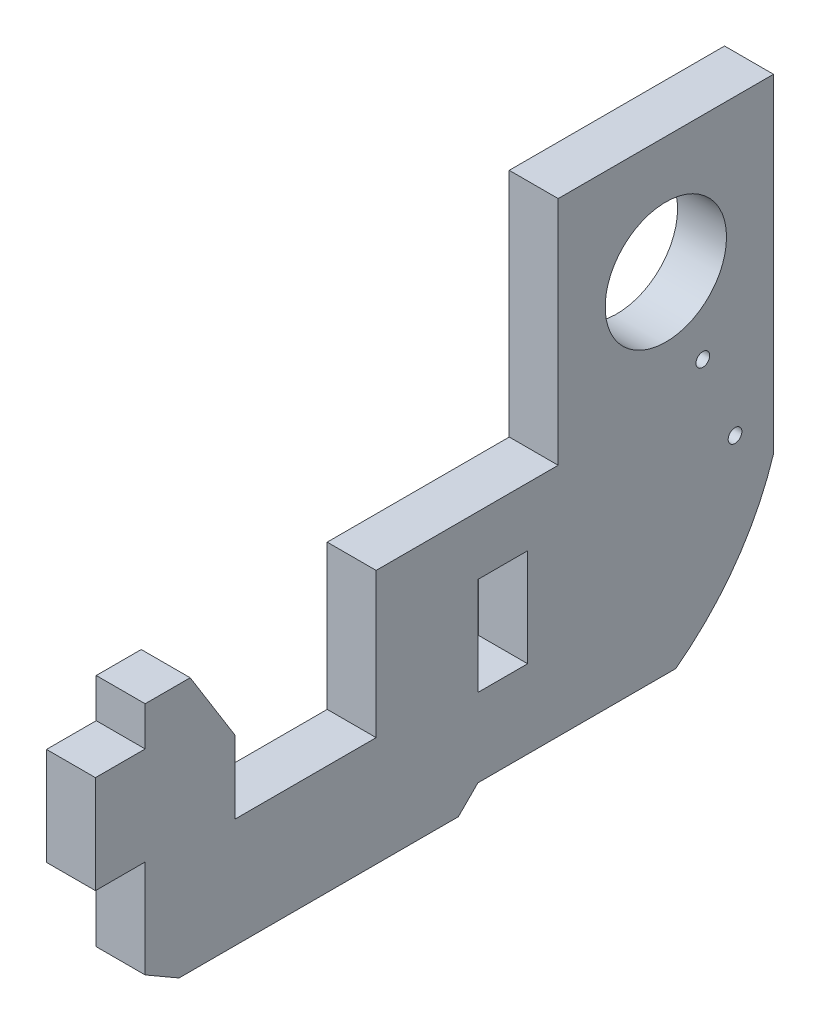
ISO-10303-21;
HEADER;
FILE_DESCRIPTION(('STEP AP214'),'2;1');
FILE_NAME('part.step','',(''),(''),'','','');
FILE_SCHEMA(('AUTOMOTIVE_DESIGN { 1 0 10303 214 1 1 1 1 }'));
ENDSEC;
DATA;
#1=APPLICATION_CONTEXT('core data for automotive mechanical design processes');
#2=APPLICATION_PROTOCOL_DEFINITION('international standard','automotive_design',2000,#1);
#3=PRODUCT_CONTEXT('',#1,'mechanical');
#4=PRODUCT('Part','Part','',(#3));
#5=PRODUCT_RELATED_PRODUCT_CATEGORY('part','',(#4));
#6=PRODUCT_DEFINITION_FORMATION('','',#4);
#7=PRODUCT_DEFINITION_CONTEXT('part definition',#1,'design');
#8=PRODUCT_DEFINITION('design','',#6,#7);
#9=PRODUCT_DEFINITION_SHAPE('','',#8);
#10=(LENGTH_UNIT() NAMED_UNIT(*) SI_UNIT(.MILLI.,.METRE.));
#11=(NAMED_UNIT(*) PLANE_ANGLE_UNIT() SI_UNIT($,.RADIAN.));
#12=(NAMED_UNIT(*) SI_UNIT($,.STERADIAN.) SOLID_ANGLE_UNIT());
#13=UNCERTAINTY_MEASURE_WITH_UNIT(LENGTH_MEASURE(1.E-05),#10,'distance_accuracy_value','');
#14=(GEOMETRIC_REPRESENTATION_CONTEXT(3) GLOBAL_UNCERTAINTY_ASSIGNED_CONTEXT((#13)) GLOBAL_UNIT_ASSIGNED_CONTEXT((#10,
#11,#12)) REPRESENTATION_CONTEXT('',''));
#15=CARTESIAN_POINT('',(0.,0.,0.));
#16=DIRECTION('',(0.,0.,1.));
#17=DIRECTION('',(1.,0.,0.));
#18=AXIS2_PLACEMENT_3D('',#15,#16,#17);
#19=CARTESIAN_POINT('',(3.175,-7.366,6.98500000000005));
#20=DIRECTION('',(-1.,0.,0.));
#21=DIRECTION('',(0.,0.,1.));
#22=AXIS2_PLACEMENT_3D('',#19,#20,#21);
#23=PLANE('',#22);
#24=CARTESIAN_POINT('',(3.175,-6.11130234075188,-2.40063044009705));
#25=DIRECTION('',(1.,0.,0.));
#26=DIRECTION('',(0.,0.,-1.));
#27=AXIS2_PLACEMENT_3D('',#24,#25,#26);
#28=CIRCLE('',#27,0.4445);
#29=CARTESIAN_POINT('',(3.175,-6.11130234075188,-2.84513044009705));
#30=VERTEX_POINT('',#29);
#31=EDGE_CURVE('E319',#30,#30,#28,.T.);
#32=ORIENTED_EDGE('',*,*,#31,.F.);
#33=EDGE_LOOP('',(#32));
#34=FACE_BOUND('',#33,.T.);
#35=CARTESIAN_POINT('',(3.175,0.,0.));
#36=DIRECTION('',(1.,0.,0.));
#37=DIRECTION('',(0.,0.,-1.));
#38=AXIS2_PLACEMENT_3D('',#35,#36,#37);
#39=CIRCLE('',#38,3.937);
#40=CARTESIAN_POINT('',(3.175,0.,-3.937));
#41=VERTEX_POINT('',#40);
#42=EDGE_CURVE('E231',#41,#41,#39,.T.);
#43=ORIENTED_EDGE('',*,*,#42,.F.);
#44=EDGE_LOOP('',(#43));
#45=FACE_BOUND('',#44,.T.);
#46=DIRECTION('',(0.,0.,-1.));
#47=VECTOR('',#46,1.);
#48=CARTESIAN_POINT('',(3.175,-22.606,33.782));
#49=LINE('',#48,#47);
#50=CARTESIAN_POINT('',(3.175,-22.606,12.1919999999999));
#51=VERTEX_POINT('',#50);
#52=CARTESIAN_POINT('',(3.175,-22.606,-0.634999999999901));
#53=VERTEX_POINT('',#52);
#54=EDGE_CURVE('E198',#51,#53,#49,.T.);
#55=ORIENTED_EDGE('',*,*,#54,.T.);
#56=CARTESIAN_POINT('',(3.175,-8.32639222260822,9.9584508883486));
#57=DIRECTION('',(-1.,0.,0.));
#58=DIRECTION('',(0.,0.,1.));
#59=AXIS2_PLACEMENT_3D('',#56,#57,#58);
#60=CIRCLE('',#59,17.78);
#61=CARTESIAN_POINT('',(3.175,-13.716,-6.9849999999999));
#62=VERTEX_POINT('',#61);
#63=EDGE_CURVE('E185',#62,#53,#60,.T.);
#64=ORIENTED_EDGE('',*,*,#63,.F.);
#65=DIRECTION('',(0.,1.,0.));
#66=VECTOR('',#65,1.);
#67=CARTESIAN_POINT('',(3.175,-22.606,-6.9849999999999));
#68=LINE('',#67,#66);
#69=CARTESIAN_POINT('',(3.175,7.62,-6.985));
#70=VERTEX_POINT('',#69);
#71=EDGE_CURVE('E207',#62,#70,#68,.T.);
#72=ORIENTED_EDGE('',*,*,#71,.T.);
#73=DIRECTION('',(0.,0.,1.));
#74=VECTOR('',#73,1.);
#75=CARTESIAN_POINT('',(3.175,7.62,6.985));
#76=LINE('',#75,#74);
#77=CARTESIAN_POINT('',(3.175,7.62,6.985));
#78=VERTEX_POINT('',#77);
#79=EDGE_CURVE('E210',#70,#78,#76,.T.);
#80=ORIENTED_EDGE('',*,*,#79,.T.);
#81=DIRECTION('',(0.,-1.,0.));
#82=VECTOR('',#81,1.);
#83=CARTESIAN_POINT('',(3.175,7.62,6.985));
#84=LINE('',#83,#82);
#85=CARTESIAN_POINT('',(3.175,-7.366,6.98500000000005));
#86=VERTEX_POINT('',#85);
#87=EDGE_CURVE('E258',#78,#86,#84,.T.);
#88=ORIENTED_EDGE('',*,*,#87,.T.);
#89=DIRECTION('',(0.,0.,1.));
#90=VECTOR('',#89,1.);
#91=CARTESIAN_POINT('',(3.175,-7.366,6.98500000000005));
#92=LINE('',#91,#90);
#93=CARTESIAN_POINT('',(3.175,-7.366,18.796));
#94=VERTEX_POINT('',#93);
#95=EDGE_CURVE('E362',#86,#94,#92,.T.);
#96=ORIENTED_EDGE('',*,*,#95,.T.);
#97=DIRECTION('',(0.,-1.,0.));
#98=VECTOR('',#97,1.);
#99=CARTESIAN_POINT('',(3.175,-7.366,18.796));
#100=LINE('',#99,#98);
#101=CARTESIAN_POINT('',(3.175,-16.764,18.796));
#102=VERTEX_POINT('',#101);
#103=EDGE_CURVE('E364',#94,#102,#100,.T.);
#104=ORIENTED_EDGE('',*,*,#103,.T.);
#105=DIRECTION('',(0.,0.,1.));
#106=VECTOR('',#105,1.);
#107=CARTESIAN_POINT('',(3.175,-16.764,18.796));
#108=LINE('',#107,#106);
#109=CARTESIAN_POINT('',(3.175,-16.764,27.94));
#110=VERTEX_POINT('',#109);
#111=EDGE_CURVE('E366',#102,#110,#108,.T.);
#112=ORIENTED_EDGE('',*,*,#111,.T.);
#113=DIRECTION('',(0.,1.,0.));
#114=VECTOR('',#113,1.);
#115=CARTESIAN_POINT('',(3.175,-16.764,27.94));
#116=LINE('',#115,#114);
#117=CARTESIAN_POINT('',(3.175,-12.065,27.94));
#118=VERTEX_POINT('',#117);
#119=EDGE_CURVE('E368',#110,#118,#116,.T.);
#120=ORIENTED_EDGE('',*,*,#119,.T.);
#121=DIRECTION('',(0.,-0.849285325289044,-0.527934121125622));
#122=VECTOR('',#121,1.);
#123=CARTESIAN_POINT('',(3.175,-12.065,27.94));
#124=LINE('',#123,#122);
#125=CARTESIAN_POINT('',(3.175,-7.366,30.861));
#126=VERTEX_POINT('',#125);
#127=EDGE_CURVE('E413',#126,#118,#124,.T.);
#128=ORIENTED_EDGE('',*,*,#127,.F.);
#129=DIRECTION('',(0.,0.,1.));
#130=VECTOR('',#129,1.);
#131=CARTESIAN_POINT('',(3.175,-7.366,27.94));
#132=LINE('',#131,#130);
#133=CARTESIAN_POINT('',(3.175,-7.366,33.782));
#134=VERTEX_POINT('',#133);
#135=EDGE_CURVE('E371',#126,#134,#132,.T.);
#136=ORIENTED_EDGE('',*,*,#135,.T.);
#137=DIRECTION('',(0.,-1.,0.));
#138=VECTOR('',#137,1.);
#139=CARTESIAN_POINT('',(3.175,-7.366,33.782));
#140=LINE('',#139,#138);
#141=CARTESIAN_POINT('',(3.175,-9.90600000000001,33.782));
#142=VERTEX_POINT('',#141);
#143=EDGE_CURVE('E373',#134,#142,#140,.T.);
#144=ORIENTED_EDGE('',*,*,#143,.T.);
#145=DIRECTION('',(0.,0.,1.));
#146=VECTOR('',#145,1.);
#147=CARTESIAN_POINT('',(3.175,-9.90600000000001,33.782));
#148=LINE('',#147,#146);
#149=CARTESIAN_POINT('',(3.175,-9.90600000000001,37.0078));
#150=VERTEX_POINT('',#149);
#151=EDGE_CURVE('E375',#142,#150,#148,.T.);
#152=ORIENTED_EDGE('',*,*,#151,.T.);
#153=DIRECTION('',(0.,-1.,0.));
#154=VECTOR('',#153,1.);
#155=CARTESIAN_POINT('',(3.175,-9.90600000000001,37.0078));
#156=LINE('',#155,#154);
#157=CARTESIAN_POINT('',(3.175,-16.256,37.0078));
#158=VERTEX_POINT('',#157);
#159=EDGE_CURVE('E377',#150,#158,#156,.T.);
#160=ORIENTED_EDGE('',*,*,#159,.T.);
#161=DIRECTION('',(0.,0.,-1.));
#162=VECTOR('',#161,1.);
#163=CARTESIAN_POINT('',(3.175,-16.256,37.0078));
#164=LINE('',#163,#162);
#165=CARTESIAN_POINT('',(3.175,-16.256,33.782));
#166=VERTEX_POINT('',#165);
#167=EDGE_CURVE('E213',#158,#166,#164,.T.);
#168=ORIENTED_EDGE('',*,*,#167,.T.);
#169=DIRECTION('',(0.,-1.,0.));
#170=VECTOR('',#169,1.);
#171=CARTESIAN_POINT('',(3.175,-16.256,33.782));
#172=LINE('',#171,#170);
#173=CARTESIAN_POINT('',(3.175,-22.606,33.782));
#174=VERTEX_POINT('',#173);
#175=EDGE_CURVE('E208',#166,#174,#172,.T.);
#176=ORIENTED_EDGE('',*,*,#175,.T.);
#177=DIRECTION('',(0.,0.5,0.866025403784439));
#178=VECTOR('',#177,1.);
#179=CARTESIAN_POINT('',(3.175,-23.876,31.5822954743875));
#180=LINE('',#179,#178);
#181=CARTESIAN_POINT('',(3.175,-23.876,31.5822954743875));
#182=VERTEX_POINT('',#181);
#183=EDGE_CURVE('E305',#182,#174,#180,.T.);
#184=ORIENTED_EDGE('',*,*,#183,.F.);
#185=DIRECTION('',(0.,0.,1.));
#186=VECTOR('',#185,1.);
#187=CARTESIAN_POINT('',(3.175,-23.876,13.462));
#188=LINE('',#187,#186);
#189=CARTESIAN_POINT('',(3.175,-23.876,13.462));
#190=VERTEX_POINT('',#189);
#191=EDGE_CURVE('E300',#190,#182,#188,.T.);
#192=ORIENTED_EDGE('',*,*,#191,.F.);
#193=DIRECTION('',(0.,-0.707106781186544,0.707106781186551));
#194=VECTOR('',#193,1.);
#195=CARTESIAN_POINT('',(3.175,-23.876,13.462));
#196=LINE('',#195,#194);
#197=EDGE_CURVE('E206',#51,#190,#196,.T.);
#198=ORIENTED_EDGE('',*,*,#197,.F.);
#199=EDGE_LOOP('',(#55,#64,#72,#80,#88,#96,#104,#112,#120,#128,#136,#144,#152,#160,#168,#176,
#184,#192,#198));
#200=FACE_BOUND('',#199,.T.);
#201=DIRECTION('',(0.,1.,0.));
#202=VECTOR('',#201,1.);
#203=CARTESIAN_POINT('',(3.175,-11.176,8.9662));
#204=LINE('',#203,#202);
#205=CARTESIAN_POINT('',(3.175,-17.526,8.9662));
#206=VERTEX_POINT('',#205);
#207=CARTESIAN_POINT('',(3.175,-11.176,8.9662));
#208=VERTEX_POINT('',#207);
#209=EDGE_CURVE('E325',#206,#208,#204,.T.);
#210=ORIENTED_EDGE('',*,*,#209,.F.);
#211=DIRECTION('',(0.,0.,-1.));
#212=VECTOR('',#211,1.);
#213=CARTESIAN_POINT('',(3.175,-17.526,12.192));
#214=LINE('',#213,#212);
#215=CARTESIAN_POINT('',(3.175,-17.526,12.192));
#216=VERTEX_POINT('',#215);
#217=EDGE_CURVE('E333',#216,#206,#214,.T.);
#218=ORIENTED_EDGE('',*,*,#217,.F.);
#219=DIRECTION('',(0.,-1.,0.));
#220=VECTOR('',#219,1.);
#221=CARTESIAN_POINT('',(3.175,-11.176,12.192));
#222=LINE('',#221,#220);
#223=CARTESIAN_POINT('',(3.175,-11.176,12.192));
#224=VERTEX_POINT('',#223);
#225=EDGE_CURVE('E330',#224,#216,#222,.T.);
#226=ORIENTED_EDGE('',*,*,#225,.F.);
#227=DIRECTION('',(0.,0.,1.));
#228=VECTOR('',#227,1.);
#229=CARTESIAN_POINT('',(3.175,-11.176,12.192));
#230=LINE('',#229,#228);
#231=EDGE_CURVE('E327',#208,#224,#230,.T.);
#232=ORIENTED_EDGE('',*,*,#231,.F.);
#233=EDGE_LOOP('',(#210,#218,#226,#232));
#234=FACE_BOUND('',#233,.T.);
#235=CARTESIAN_POINT('',(3.175,-11.4306521271298,-4.49006645368899));
#236=DIRECTION('',(1.,0.,0.));
#237=DIRECTION('',(0.,0.,-1.));
#238=AXIS2_PLACEMENT_3D('',#235,#236,#237);
#239=CIRCLE('',#238,0.4445);
#240=CARTESIAN_POINT('',(3.175,-11.4306521271298,-4.93456645368899));
#241=VERTEX_POINT('',#240);
#242=EDGE_CURVE('E311',#241,#241,#239,.T.);
#243=ORIENTED_EDGE('',*,*,#242,.F.);
#244=EDGE_LOOP('',(#243));
#245=FACE_BOUND('',#244,.T.);
#246=ADVANCED_FACE('F33',(#34,#45,#200,#234,#245),#23,.F.);
#247=CARTESIAN_POINT('',(0.,-7.366,6.98500000000005));
#248=DIRECTION('',(-1.,0.,0.));
#249=DIRECTION('',(0.,0.,1.));
#250=AXIS2_PLACEMENT_3D('',#247,#248,#249);
#251=PLANE('',#250);
#252=CARTESIAN_POINT('',(0.,-8.32639222260822,9.9584508883486));
#253=DIRECTION('',(-1.,0.,0.));
#254=DIRECTION('',(0.,0.,1.));
#255=AXIS2_PLACEMENT_3D('',#252,#253,#254);
#256=CIRCLE('',#255,17.78);
#257=CARTESIAN_POINT('',(0.,-22.606,-0.634999999999901));
#258=VERTEX_POINT('',#257);
#259=CARTESIAN_POINT('',(0.,-13.7159999999999,-6.98499999999993));
#260=VERTEX_POINT('',#259);
#261=EDGE_CURVE('E48',#258,#260,#256,.F.);
#262=ORIENTED_EDGE('',*,*,#261,.F.);
#263=DIRECTION('',(0.,0.,-1.));
#264=VECTOR('',#263,1.);
#265=CARTESIAN_POINT('',(0.,-22.606,33.782));
#266=LINE('',#265,#264);
#267=CARTESIAN_POINT('',(0.,-22.606,12.1919999999999));
#268=VERTEX_POINT('',#267);
#269=EDGE_CURVE('E200',#268,#258,#266,.T.);
#270=ORIENTED_EDGE('',*,*,#269,.F.);
#271=DIRECTION('',(0.,-0.707106781186544,0.707106781186551));
#272=VECTOR('',#271,1.);
#273=CARTESIAN_POINT('',(0.,-23.876,13.462));
#274=LINE('',#273,#272);
#275=CARTESIAN_POINT('',(0.,-23.876,13.462));
#276=VERTEX_POINT('',#275);
#277=EDGE_CURVE('E220',#268,#276,#274,.T.);
#278=ORIENTED_EDGE('',*,*,#277,.T.);
#279=DIRECTION('',(0.,0.,1.));
#280=VECTOR('',#279,1.);
#281=CARTESIAN_POINT('',(0.,-23.876,13.462));
#282=LINE('',#281,#280);
#283=CARTESIAN_POINT('',(0.,-23.876,31.5822954743875));
#284=VERTEX_POINT('',#283);
#285=EDGE_CURVE('E401',#276,#284,#282,.T.);
#286=ORIENTED_EDGE('',*,*,#285,.T.);
#287=DIRECTION('',(0.,0.5,0.866025403784439));
#288=VECTOR('',#287,1.);
#289=CARTESIAN_POINT('',(0.,-23.876,31.5822954743875));
#290=LINE('',#289,#288);
#291=CARTESIAN_POINT('',(0.,-22.606,33.782));
#292=VERTEX_POINT('',#291);
#293=EDGE_CURVE('E301',#284,#292,#290,.T.);
#294=ORIENTED_EDGE('',*,*,#293,.T.);
#295=DIRECTION('',(0.,-1.,0.));
#296=VECTOR('',#295,1.);
#297=CARTESIAN_POINT('',(0.,-16.256,33.782));
#298=LINE('',#297,#296);
#299=CARTESIAN_POINT('',(0.,-16.256,33.782));
#300=VERTEX_POINT('',#299);
#301=EDGE_CURVE('E250',#300,#292,#298,.T.);
#302=ORIENTED_EDGE('',*,*,#301,.F.);
#303=DIRECTION('',(0.,0.,-1.));
#304=VECTOR('',#303,1.);
#305=CARTESIAN_POINT('',(0.,-16.256,37.0078));
#306=LINE('',#305,#304);
#307=CARTESIAN_POINT('',(0.,-16.256,37.0078));
#308=VERTEX_POINT('',#307);
#309=EDGE_CURVE('E248',#308,#300,#306,.T.);
#310=ORIENTED_EDGE('',*,*,#309,.F.);
#311=DIRECTION('',(0.,-1.,0.));
#312=VECTOR('',#311,1.);
#313=CARTESIAN_POINT('',(0.,-9.90600000000001,37.0078));
#314=LINE('',#313,#312);
#315=CARTESIAN_POINT('',(0.,-9.90600000000001,37.0078));
#316=VERTEX_POINT('',#315);
#317=EDGE_CURVE('E246',#316,#308,#314,.T.);
#318=ORIENTED_EDGE('',*,*,#317,.F.);
#319=DIRECTION('',(0.,0.,1.));
#320=VECTOR('',#319,1.);
#321=CARTESIAN_POINT('',(0.,-9.90600000000001,33.782));
#322=LINE('',#321,#320);
#323=CARTESIAN_POINT('',(0.,-9.90600000000001,33.782));
#324=VERTEX_POINT('',#323);
#325=EDGE_CURVE('E244',#324,#316,#322,.T.);
#326=ORIENTED_EDGE('',*,*,#325,.F.);
#327=DIRECTION('',(0.,-1.,0.));
#328=VECTOR('',#327,1.);
#329=CARTESIAN_POINT('',(0.,-7.366,33.782));
#330=LINE('',#329,#328);
#331=CARTESIAN_POINT('',(0.,-7.366,33.782));
#332=VERTEX_POINT('',#331);
#333=EDGE_CURVE('E242',#332,#324,#330,.T.);
#334=ORIENTED_EDGE('',*,*,#333,.F.);
#335=DIRECTION('',(0.,0.,1.));
#336=VECTOR('',#335,1.);
#337=CARTESIAN_POINT('',(0.,-7.366,27.94));
#338=LINE('',#337,#336);
#339=CARTESIAN_POINT('',(0.,-7.366,30.861));
#340=VERTEX_POINT('',#339);
#341=EDGE_CURVE('E240',#340,#332,#338,.T.);
#342=ORIENTED_EDGE('',*,*,#341,.F.);
#343=DIRECTION('',(0.,0.849285325289044,0.527934121125622));
#344=VECTOR('',#343,1.);
#345=CARTESIAN_POINT('',(0.,-18.0712033719705,24.2064141201264));
#346=LINE('',#345,#344);
#347=CARTESIAN_POINT('',(0.,-12.065,27.94));
#348=VERTEX_POINT('',#347);
#349=EDGE_CURVE('E55',#348,#340,#346,.T.);
#350=ORIENTED_EDGE('',*,*,#349,.F.);
#351=DIRECTION('',(0.,1.,0.));
#352=VECTOR('',#351,1.);
#353=CARTESIAN_POINT('',(0.,-16.764,27.94));
#354=LINE('',#353,#352);
#355=CARTESIAN_POINT('',(0.,-16.764,27.94));
#356=VERTEX_POINT('',#355);
#357=EDGE_CURVE('E237',#356,#348,#354,.T.);
#358=ORIENTED_EDGE('',*,*,#357,.F.);
#359=DIRECTION('',(0.,0.,1.));
#360=VECTOR('',#359,1.);
#361=CARTESIAN_POINT('',(0.,-16.764,18.796));
#362=LINE('',#361,#360);
#363=CARTESIAN_POINT('',(0.,-16.764,18.796));
#364=VERTEX_POINT('',#363);
#365=EDGE_CURVE('E235',#364,#356,#362,.T.);
#366=ORIENTED_EDGE('',*,*,#365,.F.);
#367=DIRECTION('',(0.,-1.,0.));
#368=VECTOR('',#367,1.);
#369=CARTESIAN_POINT('',(0.,-7.366,18.796));
#370=LINE('',#369,#368);
#371=CARTESIAN_POINT('',(0.,-7.366,18.796));
#372=VERTEX_POINT('',#371);
#373=EDGE_CURVE('E233',#372,#364,#370,.T.);
#374=ORIENTED_EDGE('',*,*,#373,.F.);
#375=DIRECTION('',(0.,0.,1.));
#376=VECTOR('',#375,1.);
#377=CARTESIAN_POINT('',(0.,-7.366,6.98500000000005));
#378=LINE('',#377,#376);
#379=CARTESIAN_POINT('',(0.,-7.366,6.98500000000005));
#380=VERTEX_POINT('',#379);
#381=EDGE_CURVE('E230',#380,#372,#378,.T.);
#382=ORIENTED_EDGE('',*,*,#381,.F.);
#383=DIRECTION('',(0.,-1.,0.));
#384=VECTOR('',#383,1.);
#385=CARTESIAN_POINT('',(0.,7.62,6.985));
#386=LINE('',#385,#384);
#387=CARTESIAN_POINT('',(0.,7.62,6.985));
#388=VERTEX_POINT('',#387);
#389=EDGE_CURVE('E227',#388,#380,#386,.T.);
#390=ORIENTED_EDGE('',*,*,#389,.F.);
#391=DIRECTION('',(0.,0.,1.));
#392=VECTOR('',#391,1.);
#393=CARTESIAN_POINT('',(0.,7.62,6.985));
#394=LINE('',#393,#392);
#395=CARTESIAN_POINT('',(0.,7.62,-6.985));
#396=VERTEX_POINT('',#395);
#397=EDGE_CURVE('E256',#396,#388,#394,.T.);
#398=ORIENTED_EDGE('',*,*,#397,.F.);
#399=DIRECTION('',(0.,1.,0.));
#400=VECTOR('',#399,1.);
#401=CARTESIAN_POINT('',(0.,-22.606,-6.9849999999999));
#402=LINE('',#401,#400);
#403=EDGE_CURVE('E254',#260,#396,#402,.T.);
#404=ORIENTED_EDGE('',*,*,#403,.F.);
#405=EDGE_LOOP('',(#262,#270,#278,#286,#294,#302,#310,#318,#326,#334,#342,#350,#358,#366,#374,
#382,#390,#398,#404));
#406=FACE_BOUND('',#405,.T.);
#407=CARTESIAN_POINT('',(0.,-6.11130234075188,-2.40063044009705));
#408=DIRECTION('',(1.,0.,0.));
#409=DIRECTION('',(0.,0.,-1.));
#410=AXIS2_PLACEMENT_3D('',#407,#408,#409);
#411=CIRCLE('',#410,0.4445);
#412=CARTESIAN_POINT('',(0.,-6.11130234075188,-2.84513044009705));
#413=VERTEX_POINT('',#412);
#414=EDGE_CURVE('E314',#413,#413,#411,.T.);
#415=ORIENTED_EDGE('',*,*,#414,.T.);
#416=EDGE_LOOP('',(#415));
#417=FACE_BOUND('',#416,.T.);
#418=CARTESIAN_POINT('',(0.,0.,0.));
#419=DIRECTION('',(1.,0.,0.));
#420=DIRECTION('',(0.,0.,-1.));
#421=AXIS2_PLACEMENT_3D('',#418,#419,#420);
#422=CIRCLE('',#421,3.937);
#423=CARTESIAN_POINT('',(0.,0.,-3.937));
#424=VERTEX_POINT('',#423);
#425=EDGE_CURVE('E355',#424,#424,#422,.T.);
#426=ORIENTED_EDGE('',*,*,#425,.T.);
#427=EDGE_LOOP('',(#426));
#428=FACE_BOUND('',#427,.T.);
#429=DIRECTION('',(0.,0.,-1.));
#430=VECTOR('',#429,1.);
#431=CARTESIAN_POINT('',(0.,-17.526,12.192));
#432=LINE('',#431,#430);
#433=CARTESIAN_POINT('',(0.,-17.526,12.192));
#434=VERTEX_POINT('',#433);
#435=CARTESIAN_POINT('',(0.,-17.526,8.9662));
#436=VERTEX_POINT('',#435);
#437=EDGE_CURVE('E328',#434,#436,#432,.T.);
#438=ORIENTED_EDGE('',*,*,#437,.T.);
#439=DIRECTION('',(0.,1.,0.));
#440=VECTOR('',#439,1.);
#441=CARTESIAN_POINT('',(0.,-11.176,8.9662));
#442=LINE('',#441,#440);
#443=CARTESIAN_POINT('',(0.,-11.176,8.9662));
#444=VERTEX_POINT('',#443);
#445=EDGE_CURVE('E322',#436,#444,#442,.T.);
#446=ORIENTED_EDGE('',*,*,#445,.T.);
#447=DIRECTION('',(0.,0.,1.));
#448=VECTOR('',#447,1.);
#449=CARTESIAN_POINT('',(0.,-11.176,12.192));
#450=LINE('',#449,#448);
#451=CARTESIAN_POINT('',(0.,-11.176,12.192));
#452=VERTEX_POINT('',#451);
#453=EDGE_CURVE('E338',#444,#452,#450,.T.);
#454=ORIENTED_EDGE('',*,*,#453,.T.);
#455=DIRECTION('',(0.,-1.,0.));
#456=VECTOR('',#455,1.);
#457=CARTESIAN_POINT('',(0.,-11.176,12.192));
#458=LINE('',#457,#456);
#459=EDGE_CURVE('E341',#452,#434,#458,.T.);
#460=ORIENTED_EDGE('',*,*,#459,.T.);
#461=EDGE_LOOP('',(#438,#446,#454,#460));
#462=FACE_BOUND('',#461,.T.);
#463=CARTESIAN_POINT('',(0.,-11.4306521271298,-4.49006645368899));
#464=DIRECTION('',(1.,0.,0.));
#465=DIRECTION('',(0.,0.,-1.));
#466=AXIS2_PLACEMENT_3D('',#463,#464,#465);
#467=CIRCLE('',#466,0.4445);
#468=CARTESIAN_POINT('',(0.,-11.4306521271298,-4.93456645368899));
#469=VERTEX_POINT('',#468);
#470=EDGE_CURVE('E315',#469,#469,#467,.T.);
#471=ORIENTED_EDGE('',*,*,#470,.T.);
#472=EDGE_LOOP('',(#471));
#473=FACE_BOUND('',#472,.T.);
#474=ADVANCED_FACE('F397',(#406,#417,#428,#462,#473),#251,.T.);
#475=CARTESIAN_POINT('',(3.175,7.62,6.985));
#476=DIRECTION('',(0.,0.,-1.));
#477=DIRECTION('',(0.,1.,0.));
#478=AXIS2_PLACEMENT_3D('',#475,#476,#477);
#479=PLANE('',#478);
#480=ORIENTED_EDGE('',*,*,#389,.T.);
#481=DIRECTION('',(-1.,0.,0.));
#482=VECTOR('',#481,1.);
#483=CARTESIAN_POINT('',(3.175,-7.366,6.98500000000005));
#484=LINE('',#483,#482);
#485=EDGE_CURVE('E289',#86,#380,#484,.T.);
#486=ORIENTED_EDGE('',*,*,#485,.F.);
#487=ORIENTED_EDGE('',*,*,#87,.F.);
#488=DIRECTION('',(-1.,0.,0.));
#489=VECTOR('',#488,1.);
#490=CARTESIAN_POINT('',(3.175,7.62,6.985));
#491=LINE('',#490,#489);
#492=EDGE_CURVE('E226',#78,#388,#491,.T.);
#493=ORIENTED_EDGE('',*,*,#492,.T.);
#494=EDGE_LOOP('',(#480,#486,#487,#493));
#495=FACE_BOUND('',#494,.T.);
#496=ADVANCED_FACE('F35',(#495),#479,.F.);
#497=CARTESIAN_POINT('',(3.175,-7.366,6.98500000000005));
#498=DIRECTION('',(0.,-1.,0.));
#499=DIRECTION('',(0.,0.,-1.));
#500=AXIS2_PLACEMENT_3D('',#497,#498,#499);
#501=PLANE('',#500);
#502=ORIENTED_EDGE('',*,*,#381,.T.);
#503=DIRECTION('',(-1.,0.,0.));
#504=VECTOR('',#503,1.);
#505=CARTESIAN_POINT('',(3.175,-7.366,18.796));
#506=LINE('',#505,#504);
#507=EDGE_CURVE('E287',#94,#372,#506,.T.);
#508=ORIENTED_EDGE('',*,*,#507,.F.);
#509=ORIENTED_EDGE('',*,*,#95,.F.);
#510=ORIENTED_EDGE('',*,*,#485,.T.);
#511=EDGE_LOOP('',(#502,#508,#509,#510));
#512=FACE_BOUND('',#511,.T.);
#513=ADVANCED_FACE('F676',(#512),#501,.F.);
#514=CARTESIAN_POINT('',(3.175,-7.366,18.796));
#515=DIRECTION('',(0.,0.,-1.));
#516=DIRECTION('',(-1.,0.,0.));
#517=AXIS2_PLACEMENT_3D('',#514,#515,#516);
#518=PLANE('',#517);
#519=ORIENTED_EDGE('',*,*,#373,.T.);
#520=DIRECTION('',(-1.,0.,0.));
#521=VECTOR('',#520,1.);
#522=CARTESIAN_POINT('',(3.175,-16.764,18.796));
#523=LINE('',#522,#521);
#524=EDGE_CURVE('E284',#102,#364,#523,.T.);
#525=ORIENTED_EDGE('',*,*,#524,.F.);
#526=ORIENTED_EDGE('',*,*,#103,.F.);
#527=ORIENTED_EDGE('',*,*,#507,.T.);
#528=EDGE_LOOP('',(#519,#525,#526,#527));
#529=FACE_BOUND('',#528,.T.);
#530=ADVANCED_FACE('F668',(#529),#518,.F.);
#531=CARTESIAN_POINT('',(3.175,-16.764,18.796));
#532=DIRECTION('',(0.,-1.,0.));
#533=DIRECTION('',(0.,0.,-1.));
#534=AXIS2_PLACEMENT_3D('',#531,#532,#533);
#535=PLANE('',#534);
#536=ORIENTED_EDGE('',*,*,#365,.T.);
#537=DIRECTION('',(-1.,0.,0.));
#538=VECTOR('',#537,1.);
#539=CARTESIAN_POINT('',(3.175,-16.764,27.94));
#540=LINE('',#539,#538);
#541=EDGE_CURVE('E281',#110,#356,#540,.T.);
#542=ORIENTED_EDGE('',*,*,#541,.F.);
#543=ORIENTED_EDGE('',*,*,#111,.F.);
#544=ORIENTED_EDGE('',*,*,#524,.T.);
#545=EDGE_LOOP('',(#536,#542,#543,#544));
#546=FACE_BOUND('',#545,.T.);
#547=ADVANCED_FACE('F429',(#546),#535,.F.);
#548=CARTESIAN_POINT('',(3.175,-16.764,27.94));
#549=DIRECTION('',(0.,0.,1.));
#550=DIRECTION('',(1.,0.,0.));
#551=AXIS2_PLACEMENT_3D('',#548,#549,#550);
#552=PLANE('',#551);
#553=ORIENTED_EDGE('',*,*,#357,.T.);
#554=DIRECTION('',(1.,0.,0.));
#555=VECTOR('',#554,1.);
#556=CARTESIAN_POINT('',(-5.00000000001367E-05,-12.065,27.94));
#557=LINE('',#556,#555);
#558=EDGE_CURVE('E410',#348,#118,#557,.T.);
#559=ORIENTED_EDGE('',*,*,#558,.T.);
#560=ORIENTED_EDGE('',*,*,#119,.F.);
#561=ORIENTED_EDGE('',*,*,#541,.T.);
#562=EDGE_LOOP('',(#553,#559,#560,#561));
#563=FACE_BOUND('',#562,.T.);
#564=ADVANCED_FACE('F422',(#563),#552,.F.);
#565=CARTESIAN_POINT('',(3.175,-7.366,27.94));
#566=DIRECTION('',(0.,-1.,0.));
#567=DIRECTION('',(0.,0.,-1.));
#568=AXIS2_PLACEMENT_3D('',#565,#566,#567);
#569=PLANE('',#568);
#570=ORIENTED_EDGE('',*,*,#135,.F.);
#571=DIRECTION('',(-1.,0.,0.));
#572=VECTOR('',#571,1.);
#573=CARTESIAN_POINT('',(3.175,-7.366,30.861));
#574=LINE('',#573,#572);
#575=EDGE_CURVE('E41',#126,#340,#574,.T.);
#576=ORIENTED_EDGE('',*,*,#575,.T.);
#577=ORIENTED_EDGE('',*,*,#341,.T.);
#578=DIRECTION('',(-1.,0.,0.));
#579=VECTOR('',#578,1.);
#580=CARTESIAN_POINT('',(3.175,-7.366,33.782));
#581=LINE('',#580,#579);
#582=EDGE_CURVE('E278',#134,#332,#581,.T.);
#583=ORIENTED_EDGE('',*,*,#582,.F.);
#584=EDGE_LOOP('',(#570,#576,#577,#583));
#585=FACE_BOUND('',#584,.T.);
#586=ADVANCED_FACE('F435',(#585),#569,.F.);
#587=CARTESIAN_POINT('',(3.175,-7.366,33.782));
#588=DIRECTION('',(0.,0.,-1.));
#589=DIRECTION('',(0.,1.,0.));
#590=AXIS2_PLACEMENT_3D('',#587,#588,#589);
#591=PLANE('',#590);
#592=ORIENTED_EDGE('',*,*,#333,.T.);
#593=DIRECTION('',(-1.,0.,0.));
#594=VECTOR('',#593,1.);
#595=CARTESIAN_POINT('',(3.175,-9.90600000000001,33.782));
#596=LINE('',#595,#594);
#597=EDGE_CURVE('E275',#142,#324,#596,.T.);
#598=ORIENTED_EDGE('',*,*,#597,.F.);
#599=ORIENTED_EDGE('',*,*,#143,.F.);
#600=ORIENTED_EDGE('',*,*,#582,.T.);
#601=EDGE_LOOP('',(#592,#598,#599,#600));
#602=FACE_BOUND('',#601,.T.);
#603=ADVANCED_FACE('F438',(#602),#591,.F.);
#604=CARTESIAN_POINT('',(3.175,-9.90600000000001,33.782));
#605=DIRECTION('',(0.,-1.,0.));
#606=DIRECTION('',(0.,0.,-1.));
#607=AXIS2_PLACEMENT_3D('',#604,#605,#606);
#608=PLANE('',#607);
#609=ORIENTED_EDGE('',*,*,#325,.T.);
#610=DIRECTION('',(-1.,0.,0.));
#611=VECTOR('',#610,1.);
#612=CARTESIAN_POINT('',(3.175,-9.90600000000001,37.0078));
#613=LINE('',#612,#611);
#614=EDGE_CURVE('E272',#150,#316,#613,.T.);
#615=ORIENTED_EDGE('',*,*,#614,.F.);
#616=ORIENTED_EDGE('',*,*,#151,.F.);
#617=ORIENTED_EDGE('',*,*,#597,.T.);
#618=EDGE_LOOP('',(#609,#615,#616,#617));
#619=FACE_BOUND('',#618,.T.);
#620=ADVANCED_FACE('F443',(#619),#608,.F.);
#621=CARTESIAN_POINT('',(3.175,-9.90600000000001,37.0078));
#622=DIRECTION('',(0.,0.,-1.));
#623=DIRECTION('',(-1.,0.,0.));
#624=AXIS2_PLACEMENT_3D('',#621,#622,#623);
#625=PLANE('',#624);
#626=ORIENTED_EDGE('',*,*,#317,.T.);
#627=DIRECTION('',(-1.,0.,0.));
#628=VECTOR('',#627,1.);
#629=CARTESIAN_POINT('',(3.175,-16.256,37.0078));
#630=LINE('',#629,#628);
#631=EDGE_CURVE('E269',#158,#308,#630,.T.);
#632=ORIENTED_EDGE('',*,*,#631,.F.);
#633=ORIENTED_EDGE('',*,*,#159,.F.);
#634=ORIENTED_EDGE('',*,*,#614,.T.);
#635=EDGE_LOOP('',(#626,#632,#633,#634));
#636=FACE_BOUND('',#635,.T.);
#637=ADVANCED_FACE('F446',(#636),#625,.F.);
#638=CARTESIAN_POINT('',(3.175,-16.256,37.0078));
#639=DIRECTION('',(0.,1.,0.));
#640=DIRECTION('',(0.,0.,1.));
#641=AXIS2_PLACEMENT_3D('',#638,#639,#640);
#642=PLANE('',#641);
#643=ORIENTED_EDGE('',*,*,#309,.T.);
#644=DIRECTION('',(-1.,0.,0.));
#645=VECTOR('',#644,1.);
#646=CARTESIAN_POINT('',(3.175,-16.256,33.782));
#647=LINE('',#646,#645);
#648=EDGE_CURVE('E266',#166,#300,#647,.T.);
#649=ORIENTED_EDGE('',*,*,#648,.F.);
#650=ORIENTED_EDGE('',*,*,#167,.F.);
#651=ORIENTED_EDGE('',*,*,#631,.T.);
#652=EDGE_LOOP('',(#643,#649,#650,#651));
#653=FACE_BOUND('',#652,.T.);
#654=ADVANCED_FACE('F386',(#653),#642,.F.);
#655=CARTESIAN_POINT('',(3.175,-16.256,33.782));
#656=DIRECTION('',(0.,0.,-1.));
#657=DIRECTION('',(0.,1.,0.));
#658=AXIS2_PLACEMENT_3D('',#655,#656,#657);
#659=PLANE('',#658);
#660=ORIENTED_EDGE('',*,*,#301,.T.);
#661=DIRECTION('',(-1.,0.,0.));
#662=VECTOR('',#661,1.);
#663=CARTESIAN_POINT('',(3.175,-22.606,33.782));
#664=LINE('',#663,#662);
#665=EDGE_CURVE('E264',#174,#292,#664,.T.);
#666=ORIENTED_EDGE('',*,*,#665,.F.);
#667=ORIENTED_EDGE('',*,*,#175,.F.);
#668=ORIENTED_EDGE('',*,*,#648,.T.);
#669=EDGE_LOOP('',(#660,#666,#667,#668));
#670=FACE_BOUND('',#669,.T.);
#671=ADVANCED_FACE('F390',(#670),#659,.F.);
#672=CARTESIAN_POINT('',(3.175,-22.606,33.782));
#673=DIRECTION('',(0.,1.,0.));
#674=DIRECTION('',(0.,0.,1.));
#675=AXIS2_PLACEMENT_3D('',#672,#673,#674);
#676=PLANE('',#675);
#677=ORIENTED_EDGE('',*,*,#269,.T.);
#678=DIRECTION('',(1.,0.,0.));
#679=VECTOR('',#678,1.);
#680=CARTESIAN_POINT('',(-5.00000000001367E-05,-22.606,-0.634999999999901));
#681=LINE('',#680,#679);
#682=EDGE_CURVE('E188',#258,#53,#681,.T.);
#683=ORIENTED_EDGE('',*,*,#682,.T.);
#684=ORIENTED_EDGE('',*,*,#54,.F.);
#685=DIRECTION('',(-1.,0.,0.));
#686=VECTOR('',#685,1.);
#687=CARTESIAN_POINT('',(3.175,-22.606,12.1919999999999));
#688=LINE('',#687,#686);
#689=EDGE_CURVE('E302',#51,#268,#688,.T.);
#690=ORIENTED_EDGE('',*,*,#689,.T.);
#691=EDGE_LOOP('',(#677,#683,#684,#690));
#692=FACE_BOUND('',#691,.T.);
#693=ADVANCED_FACE('F196',(#692),#676,.F.);
#694=CARTESIAN_POINT('',(3.175,-22.606,-6.9849999999999));
#695=DIRECTION('',(0.,0.,1.));
#696=DIRECTION('',(0.,-1.,0.));
#697=AXIS2_PLACEMENT_3D('',#694,#695,#696);
#698=PLANE('',#697);
#699=ORIENTED_EDGE('',*,*,#71,.F.);
#700=DIRECTION('',(1.,0.,0.));
#701=VECTOR('',#700,1.);
#702=CARTESIAN_POINT('',(-5.00000000001367E-05,-13.7159999999999,-6.98499999999993));
#703=LINE('',#702,#701);
#704=EDGE_CURVE('E11',#62,#260,#703,.F.);
#705=ORIENTED_EDGE('',*,*,#704,.T.);
#706=ORIENTED_EDGE('',*,*,#403,.T.);
#707=DIRECTION('',(-1.,0.,0.));
#708=VECTOR('',#707,1.);
#709=CARTESIAN_POINT('',(3.175,7.62,-6.985));
#710=LINE('',#709,#708);
#711=EDGE_CURVE('E261',#70,#396,#710,.T.);
#712=ORIENTED_EDGE('',*,*,#711,.F.);
#713=EDGE_LOOP('',(#699,#705,#706,#712));
#714=FACE_BOUND('',#713,.T.);
#715=ADVANCED_FACE('F471',(#714),#698,.F.);
#716=CARTESIAN_POINT('',(3.175,7.62,6.985));
#717=DIRECTION('',(0.,-1.,0.));
#718=DIRECTION('',(0.,0.,-1.));
#719=AXIS2_PLACEMENT_3D('',#716,#717,#718);
#720=PLANE('',#719);
#721=ORIENTED_EDGE('',*,*,#397,.T.);
#722=ORIENTED_EDGE('',*,*,#492,.F.);
#723=ORIENTED_EDGE('',*,*,#79,.F.);
#724=ORIENTED_EDGE('',*,*,#711,.T.);
#725=EDGE_LOOP('',(#721,#722,#723,#724));
#726=FACE_BOUND('',#725,.T.);
#727=ADVANCED_FACE('F468',(#726),#720,.F.);
#728=CARTESIAN_POINT('',(3.175,0.,0.));
#729=DIRECTION('',(-1.,0.,0.));
#730=DIRECTION('',(0.,0.,1.));
#731=AXIS2_PLACEMENT_3D('',#728,#729,#730);
#732=CYLINDRICAL_SURFACE('',#731,3.937);
#733=ORIENTED_EDGE('',*,*,#42,.T.);
#734=EDGE_LOOP('',(#733));
#735=FACE_BOUND('',#734,.T.);
#736=ORIENTED_EDGE('',*,*,#425,.F.);
#737=EDGE_LOOP('',(#736));
#738=FACE_BOUND('',#737,.T.);
#739=ADVANCED_FACE('F465',(#735,#738),#732,.F.);
#740=CARTESIAN_POINT('',(3.175,-11.176,8.9662));
#741=DIRECTION('',(0.,0.,1.));
#742=DIRECTION('',(1.,0.,0.));
#743=AXIS2_PLACEMENT_3D('',#740,#741,#742);
#744=PLANE('',#743);
#745=ORIENTED_EDGE('',*,*,#445,.F.);
#746=DIRECTION('',(-1.,0.,0.));
#747=VECTOR('',#746,1.);
#748=CARTESIAN_POINT('',(3.175,-17.526,8.9662));
#749=LINE('',#748,#747);
#750=EDGE_CURVE('E335',#206,#436,#749,.T.);
#751=ORIENTED_EDGE('',*,*,#750,.F.);
#752=ORIENTED_EDGE('',*,*,#209,.T.);
#753=DIRECTION('',(-1.,0.,0.));
#754=VECTOR('',#753,1.);
#755=CARTESIAN_POINT('',(3.175,-11.176,8.9662));
#756=LINE('',#755,#754);
#757=EDGE_CURVE('E352',#208,#444,#756,.T.);
#758=ORIENTED_EDGE('',*,*,#757,.T.);
#759=EDGE_LOOP('',(#745,#751,#752,#758));
#760=FACE_BOUND('',#759,.T.);
#761=ADVANCED_FACE('F505',(#760),#744,.T.);
#762=CARTESIAN_POINT('',(3.175,-11.176,12.192));
#763=DIRECTION('',(0.,-1.,0.));
#764=DIRECTION('',(0.,0.,-1.));
#765=AXIS2_PLACEMENT_3D('',#762,#763,#764);
#766=PLANE('',#765);
#767=ORIENTED_EDGE('',*,*,#453,.F.);
#768=ORIENTED_EDGE('',*,*,#757,.F.);
#769=ORIENTED_EDGE('',*,*,#231,.T.);
#770=DIRECTION('',(-1.,0.,0.));
#771=VECTOR('',#770,1.);
#772=CARTESIAN_POINT('',(3.175,-11.176,12.192));
#773=LINE('',#772,#771);
#774=EDGE_CURVE('E350',#224,#452,#773,.T.);
#775=ORIENTED_EDGE('',*,*,#774,.T.);
#776=EDGE_LOOP('',(#767,#768,#769,#775));
#777=FACE_BOUND('',#776,.T.);
#778=ADVANCED_FACE('F512',(#777),#766,.T.);
#779=CARTESIAN_POINT('',(3.175,-11.176,12.192));
#780=DIRECTION('',(0.,0.,-1.));
#781=DIRECTION('',(-1.,0.,0.));
#782=AXIS2_PLACEMENT_3D('',#779,#780,#781);
#783=PLANE('',#782);
#784=ORIENTED_EDGE('',*,*,#459,.F.);
#785=ORIENTED_EDGE('',*,*,#774,.F.);
#786=ORIENTED_EDGE('',*,*,#225,.T.);
#787=DIRECTION('',(-1.,0.,0.));
#788=VECTOR('',#787,1.);
#789=CARTESIAN_POINT('',(3.175,-17.526,12.192));
#790=LINE('',#789,#788);
#791=EDGE_CURVE('E348',#216,#434,#790,.T.);
#792=ORIENTED_EDGE('',*,*,#791,.T.);
#793=EDGE_LOOP('',(#784,#785,#786,#792));
#794=FACE_BOUND('',#793,.T.);
#795=ADVANCED_FACE('F519',(#794),#783,.T.);
#796=CARTESIAN_POINT('',(3.175,-17.526,12.192));
#797=DIRECTION('',(0.,1.,0.));
#798=DIRECTION('',(0.,0.,1.));
#799=AXIS2_PLACEMENT_3D('',#796,#797,#798);
#800=PLANE('',#799);
#801=ORIENTED_EDGE('',*,*,#437,.F.);
#802=ORIENTED_EDGE('',*,*,#791,.F.);
#803=ORIENTED_EDGE('',*,*,#217,.T.);
#804=ORIENTED_EDGE('',*,*,#750,.T.);
#805=EDGE_LOOP('',(#801,#802,#803,#804));
#806=FACE_BOUND('',#805,.T.);
#807=ADVANCED_FACE('F527',(#806),#800,.T.);
#808=CARTESIAN_POINT('',(3.175,-6.11130234075188,-2.40063044009705));
#809=DIRECTION('',(-1.,0.,0.));
#810=DIRECTION('',(0.,0.,1.));
#811=AXIS2_PLACEMENT_3D('',#808,#809,#810);
#812=CYLINDRICAL_SURFACE('',#811,0.4445);
#813=ORIENTED_EDGE('',*,*,#31,.T.);
#814=EDGE_LOOP('',(#813));
#815=FACE_BOUND('',#814,.T.);
#816=ORIENTED_EDGE('',*,*,#414,.F.);
#817=EDGE_LOOP('',(#816));
#818=FACE_BOUND('',#817,.T.);
#819=ADVANCED_FACE('F535',(#815,#818),#812,.F.);
#820=CARTESIAN_POINT('',(3.175,-11.4306521271298,-4.49006645368899));
#821=DIRECTION('',(-1.,0.,0.));
#822=DIRECTION('',(0.,0.,1.));
#823=AXIS2_PLACEMENT_3D('',#820,#821,#822);
#824=CYLINDRICAL_SURFACE('',#823,0.4445);
#825=ORIENTED_EDGE('',*,*,#242,.T.);
#826=EDGE_LOOP('',(#825));
#827=FACE_BOUND('',#826,.T.);
#828=ORIENTED_EDGE('',*,*,#470,.F.);
#829=EDGE_LOOP('',(#828));
#830=FACE_BOUND('',#829,.T.);
#831=ADVANCED_FACE('F543',(#827,#830),#824,.F.);
#832=CARTESIAN_POINT('',(3.175,-23.876,31.5822954743875));
#833=DIRECTION('',(0.,-0.866025403784439,0.5));
#834=DIRECTION('',(0.,-0.5,-0.866025403784439));
#835=AXIS2_PLACEMENT_3D('',#832,#833,#834);
#836=PLANE('',#835);
#837=ORIENTED_EDGE('',*,*,#293,.F.);
#838=DIRECTION('',(-1.,0.,0.));
#839=VECTOR('',#838,1.);
#840=CARTESIAN_POINT('',(3.175,-23.876,31.5822954743875));
#841=LINE('',#840,#839);
#842=EDGE_CURVE('E318',#182,#284,#841,.T.);
#843=ORIENTED_EDGE('',*,*,#842,.F.);
#844=ORIENTED_EDGE('',*,*,#183,.T.);
#845=ORIENTED_EDGE('',*,*,#665,.T.);
#846=EDGE_LOOP('',(#837,#843,#844,#845));
#847=FACE_BOUND('',#846,.T.);
#848=ADVANCED_FACE('F394',(#847),#836,.T.);
#849=CARTESIAN_POINT('',(3.175,-23.876,13.462));
#850=DIRECTION('',(0.,-1.,0.));
#851=DIRECTION('',(0.,0.,-1.));
#852=AXIS2_PLACEMENT_3D('',#849,#850,#851);
#853=PLANE('',#852);
#854=ORIENTED_EDGE('',*,*,#285,.F.);
#855=DIRECTION('',(-1.,0.,0.));
#856=VECTOR('',#855,1.);
#857=CARTESIAN_POINT('',(3.175,-23.876,13.462));
#858=LINE('',#857,#856);
#859=EDGE_CURVE('E304',#190,#276,#858,.T.);
#860=ORIENTED_EDGE('',*,*,#859,.F.);
#861=ORIENTED_EDGE('',*,*,#191,.T.);
#862=ORIENTED_EDGE('',*,*,#842,.T.);
#863=EDGE_LOOP('',(#854,#860,#861,#862));
#864=FACE_BOUND('',#863,.T.);
#865=ADVANCED_FACE('F409',(#864),#853,.T.);
#866=CARTESIAN_POINT('',(3.175,-23.876,13.462));
#867=DIRECTION('',(0.,-0.707106781186551,-0.707106781186544));
#868=DIRECTION('',(0.,0.707106781186544,-0.707106781186551));
#869=AXIS2_PLACEMENT_3D('',#866,#867,#868);
#870=PLANE('',#869);
#871=ORIENTED_EDGE('',*,*,#277,.F.);
#872=ORIENTED_EDGE('',*,*,#689,.F.);
#873=ORIENTED_EDGE('',*,*,#197,.T.);
#874=ORIENTED_EDGE('',*,*,#859,.T.);
#875=EDGE_LOOP('',(#871,#872,#873,#874));
#876=FACE_BOUND('',#875,.T.);
#877=ADVANCED_FACE('F408',(#876),#870,.T.);
#878=CARTESIAN_POINT('',(-5.00000000001367E-05,-12.065,27.94));
#879=DIRECTION('',(0.,-0.527934121125622,0.849285325289044));
#880=DIRECTION('',(0.,-0.849285325289044,-0.527934121125622));
#881=AXIS2_PLACEMENT_3D('',#878,#879,#880);
#882=PLANE('',#881);
#883=ORIENTED_EDGE('',*,*,#349,.T.);
#884=ORIENTED_EDGE('',*,*,#575,.F.);
#885=ORIENTED_EDGE('',*,*,#127,.T.);
#886=ORIENTED_EDGE('',*,*,#558,.F.);
#887=EDGE_LOOP('',(#883,#884,#885,#886));
#888=FACE_BOUND('',#887,.T.);
#889=ADVANCED_FACE('F419',(#888),#882,.F.);
#890=CARTESIAN_POINT('',(-5.00000000001367E-05,-8.32639222260822,9.9584508883486));
#891=DIRECTION('',(1.,0.,0.));
#892=DIRECTION('',(0.,0.,-1.));
#893=AXIS2_PLACEMENT_3D('',#890,#891,#892);
#894=CYLINDRICAL_SURFACE('',#893,17.78);
#895=ORIENTED_EDGE('',*,*,#261,.T.);
#896=ORIENTED_EDGE('',*,*,#704,.F.);
#897=ORIENTED_EDGE('',*,*,#63,.T.);
#898=ORIENTED_EDGE('',*,*,#682,.F.);
#899=EDGE_LOOP('',(#895,#896,#897,#898));
#900=FACE_BOUND('',#899,.T.);
#901=ADVANCED_FACE('F187',(#900),#894,.T.);
#902=CLOSED_SHELL('',(#246,#474,#496,#513,#530,#547,#564,#586,#603,#620,#637,#654,#671,#693,
#715,#727,#739,#761,#778,#795,#807,#819,#831,#848,#865,#877,#889,#901));
#903=MANIFOLD_SOLID_BREP('B2',#902);
#904=ADVANCED_BREP_SHAPE_REPRESENTATION('',(#18,#903),#14);
#905=SHAPE_DEFINITION_REPRESENTATION(#9,#904);
ENDSEC;
END-ISO-10303-21;
